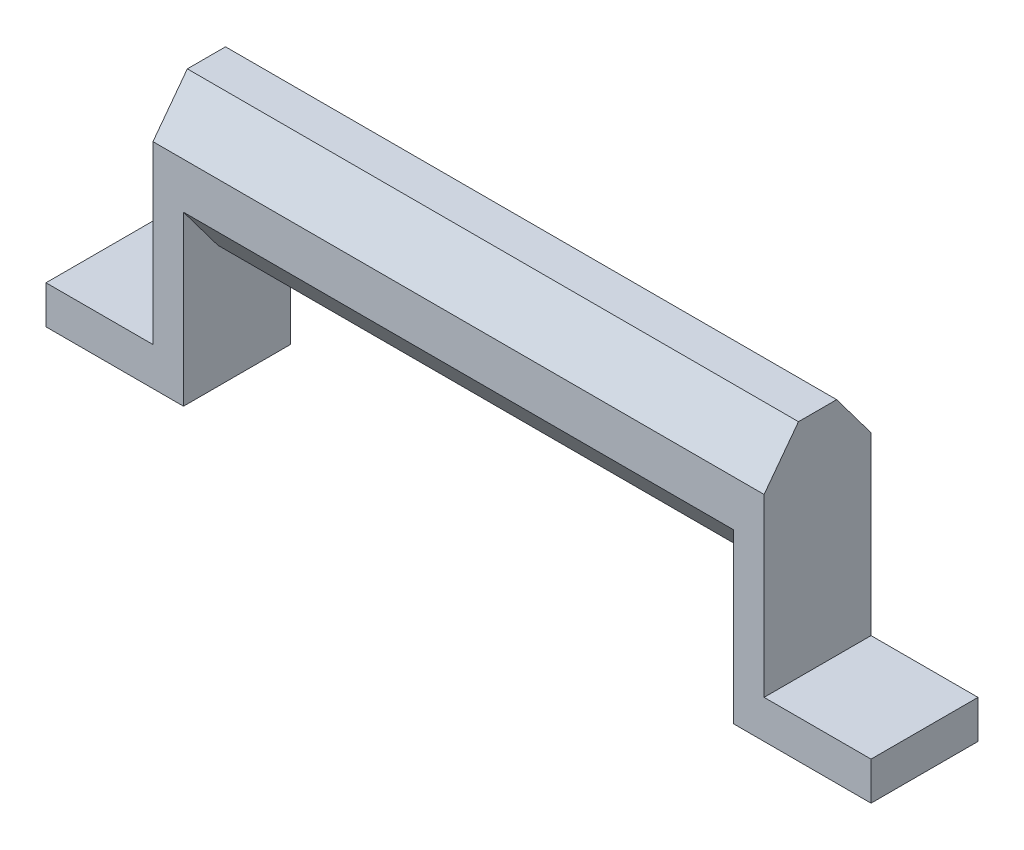
ISO-10303-21;
HEADER;
FILE_DESCRIPTION(('STEP AP214'),'2;1');
FILE_NAME('part.step','',(''),(''),'','','');
FILE_SCHEMA(('AUTOMOTIVE_DESIGN { 1 0 10303 214 1 1 1 1 }'));
ENDSEC;
DATA;
#1=APPLICATION_CONTEXT('core data for automotive mechanical design processes');
#2=APPLICATION_PROTOCOL_DEFINITION('international standard','automotive_design',2000,#1);
#3=PRODUCT_CONTEXT('',#1,'mechanical');
#4=PRODUCT('Part','Part','',(#3));
#5=PRODUCT_RELATED_PRODUCT_CATEGORY('part','',(#4));
#6=PRODUCT_DEFINITION_FORMATION('','',#4);
#7=PRODUCT_DEFINITION_CONTEXT('part definition',#1,'design');
#8=PRODUCT_DEFINITION('design','',#6,#7);
#9=PRODUCT_DEFINITION_SHAPE('','',#8);
#10=(LENGTH_UNIT() NAMED_UNIT(*) SI_UNIT(.MILLI.,.METRE.));
#11=(NAMED_UNIT(*) PLANE_ANGLE_UNIT() SI_UNIT($,.RADIAN.));
#12=(NAMED_UNIT(*) SI_UNIT($,.STERADIAN.) SOLID_ANGLE_UNIT());
#13=UNCERTAINTY_MEASURE_WITH_UNIT(LENGTH_MEASURE(1.E-05),#10,'distance_accuracy_value','');
#14=(GEOMETRIC_REPRESENTATION_CONTEXT(3) GLOBAL_UNCERTAINTY_ASSIGNED_CONTEXT((#13)) GLOBAL_UNIT_ASSIGNED_CONTEXT((#10,
#11,#12)) REPRESENTATION_CONTEXT('',''));
#15=CARTESIAN_POINT('',(0.,0.,0.));
#16=DIRECTION('',(0.,0.,1.));
#17=DIRECTION('',(1.,0.,0.));
#18=AXIS2_PLACEMENT_3D('',#15,#16,#17);
#19=CARTESIAN_POINT('',(0.,0.,0.));
#20=DIRECTION('',(1.,0.,0.));
#21=DIRECTION('',(0.,0.,-1.));
#22=AXIS2_PLACEMENT_3D('',#19,#20,#21);
#23=PLANE('',#22);
#24=DIRECTION('',(0.,0.,-1.));
#25=VECTOR('',#24,1.);
#26=CARTESIAN_POINT('',(0.,-25.4,0.));
#27=LINE('',#26,#25);
#28=CARTESIAN_POINT('',(0.,-25.4,8.89));
#29=VERTEX_POINT('',#28);
#30=CARTESIAN_POINT('',(0.,-25.4,-8.89));
#31=VERTEX_POINT('',#30);
#32=EDGE_CURVE('E61',#29,#31,#27,.T.);
#33=ORIENTED_EDGE('',*,*,#32,.F.);
#34=DIRECTION('',(0.,-1.,0.));
#35=VECTOR('',#34,1.);
#36=CARTESIAN_POINT('',(0.,0.,8.89));
#37=LINE('',#36,#35);
#38=CARTESIAN_POINT('',(0.,3.81,8.89));
#39=VERTEX_POINT('',#38);
#40=EDGE_CURVE('E299',#39,#29,#37,.T.);
#41=ORIENTED_EDGE('',*,*,#40,.F.);
#42=DIRECTION('',(0.,-0.8,0.6));
#43=VECTOR('',#42,1.);
#44=CARTESIAN_POINT('',(0.,5.6388,7.5184));
#45=LINE('',#44,#43);
#46=CARTESIAN_POINT('',(0.,11.43,3.175));
#47=VERTEX_POINT('',#46);
#48=EDGE_CURVE('E315',#47,#39,#45,.T.);
#49=ORIENTED_EDGE('',*,*,#48,.F.);
#50=DIRECTION('',(0.,0.,1.));
#51=VECTOR('',#50,1.);
#52=CARTESIAN_POINT('',(0.,11.43,0.));
#53=LINE('',#52,#51);
#54=CARTESIAN_POINT('',(0.,11.43,-3.175));
#55=VERTEX_POINT('',#54);
#56=EDGE_CURVE('E312',#55,#47,#53,.T.);
#57=ORIENTED_EDGE('',*,*,#56,.F.);
#58=DIRECTION('',(0.,0.8,0.6));
#59=VECTOR('',#58,1.);
#60=CARTESIAN_POINT('',(0.,5.6388,-7.5184));
#61=LINE('',#60,#59);
#62=CARTESIAN_POINT('',(0.,3.81,-8.89));
#63=VERTEX_POINT('',#62);
#64=EDGE_CURVE('E309',#63,#55,#61,.T.);
#65=ORIENTED_EDGE('',*,*,#64,.F.);
#66=DIRECTION('',(0.,-1.,0.));
#67=VECTOR('',#66,1.);
#68=CARTESIAN_POINT('',(0.,0.,-8.89));
#69=LINE('',#68,#67);
#70=EDGE_CURVE('E294',#63,#31,#69,.T.);
#71=ORIENTED_EDGE('',*,*,#70,.T.);
#72=EDGE_LOOP('',(#33,#41,#49,#57,#65,#71));
#73=FACE_BOUND('',#72,.T.);
#74=ADVANCED_FACE('F45',(#73),#23,.F.);
#75=CARTESIAN_POINT('',(5.08,0.,0.));
#76=DIRECTION('',(1.,0.,0.));
#77=DIRECTION('',(0.,0.,-1.));
#78=AXIS2_PLACEMENT_3D('',#75,#76,#77);
#79=PLANE('',#78);
#80=DIRECTION('',(0.,-1.,0.));
#81=VECTOR('',#80,1.);
#82=CARTESIAN_POINT('',(5.08,0.,-8.89));
#83=LINE('',#82,#81);
#84=CARTESIAN_POINT('',(5.08,-3.81,-8.89));
#85=VERTEX_POINT('',#84);
#86=CARTESIAN_POINT('',(5.08,-31.75,-8.89));
#87=VERTEX_POINT('',#86);
#88=EDGE_CURVE('E295',#85,#87,#83,.T.);
#89=ORIENTED_EDGE('',*,*,#88,.F.);
#90=DIRECTION('',(0.,-0.8,0.6));
#91=VECTOR('',#90,1.);
#92=CARTESIAN_POINT('',(5.08,-5.6388,-7.5184));
#93=LINE('',#92,#91);
#94=CARTESIAN_POINT('',(5.08,-11.43,-3.175));
#95=VERTEX_POINT('',#94);
#96=EDGE_CURVE('E287',#85,#95,#93,.T.);
#97=ORIENTED_EDGE('',*,*,#96,.T.);
#98=DIRECTION('',(0.,0.,-1.));
#99=VECTOR('',#98,1.);
#100=CARTESIAN_POINT('',(5.08,-11.43,0.));
#101=LINE('',#100,#99);
#102=CARTESIAN_POINT('',(5.08,-11.43,3.175));
#103=VERTEX_POINT('',#102);
#104=EDGE_CURVE('E291',#103,#95,#101,.T.);
#105=ORIENTED_EDGE('',*,*,#104,.F.);
#106=DIRECTION('',(0.,0.8,0.6));
#107=VECTOR('',#106,1.);
#108=CARTESIAN_POINT('',(5.08,-5.6388,7.5184));
#109=LINE('',#108,#107);
#110=CARTESIAN_POINT('',(5.08,-3.81,8.89));
#111=VERTEX_POINT('',#110);
#112=EDGE_CURVE('E284',#103,#111,#109,.T.);
#113=ORIENTED_EDGE('',*,*,#112,.T.);
#114=DIRECTION('',(0.,-1.,0.));
#115=VECTOR('',#114,1.);
#116=CARTESIAN_POINT('',(5.08,0.,8.89));
#117=LINE('',#116,#115);
#118=CARTESIAN_POINT('',(5.08,-31.75,8.89));
#119=VERTEX_POINT('',#118);
#120=EDGE_CURVE('E298',#111,#119,#117,.T.);
#121=ORIENTED_EDGE('',*,*,#120,.T.);
#122=DIRECTION('',(0.,0.,-1.));
#123=VECTOR('',#122,1.);
#124=CARTESIAN_POINT('',(5.08,-31.75,0.));
#125=LINE('',#124,#123);
#126=EDGE_CURVE('E302',#119,#87,#125,.T.);
#127=ORIENTED_EDGE('',*,*,#126,.T.);
#128=EDGE_LOOP('',(#89,#97,#105,#113,#121,#127));
#129=FACE_BOUND('',#128,.T.);
#130=ADVANCED_FACE('F367',(#129),#79,.T.);
#131=CARTESIAN_POINT('',(5.08,0.,-8.89));
#132=DIRECTION('',(0.,0.,-1.));
#133=DIRECTION('',(0.,1.,0.));
#134=AXIS2_PLACEMENT_3D('',#131,#132,#133);
#135=PLANE('',#134);
#136=DIRECTION('',(-1.,0.,0.));
#137=VECTOR('',#136,1.);
#138=CARTESIAN_POINT('',(50.8,-3.81,-8.89));
#139=LINE('',#138,#137);
#140=CARTESIAN_POINT('',(96.52,-3.81,-8.89));
#141=VERTEX_POINT('',#140);
#142=EDGE_CURVE('E276',#141,#85,#139,.T.);
#143=ORIENTED_EDGE('',*,*,#142,.T.);
#144=ORIENTED_EDGE('',*,*,#88,.T.);
#145=DIRECTION('',(-1.,0.,0.));
#146=VECTOR('',#145,1.);
#147=CARTESIAN_POINT('',(5.08,-31.75,-8.89));
#148=LINE('',#147,#146);
#149=CARTESIAN_POINT('',(-17.78,-31.75,-8.89));
#150=VERTEX_POINT('',#149);
#151=EDGE_CURVE('E306',#87,#150,#148,.T.);
#152=ORIENTED_EDGE('',*,*,#151,.T.);
#153=DIRECTION('',(0.,-1.,0.));
#154=VECTOR('',#153,1.);
#155=CARTESIAN_POINT('',(-17.78,0.,-8.89));
#156=LINE('',#155,#154);
#157=CARTESIAN_POINT('',(-17.78,-25.4,-8.89));
#158=VERTEX_POINT('',#157);
#159=EDGE_CURVE('E256',#158,#150,#156,.T.);
#160=ORIENTED_EDGE('',*,*,#159,.F.);
#161=DIRECTION('',(1.,0.,0.));
#162=VECTOR('',#161,1.);
#163=CARTESIAN_POINT('',(-17.78,-25.4,-8.89));
#164=LINE('',#163,#162);
#165=EDGE_CURVE('E263',#158,#31,#164,.T.);
#166=ORIENTED_EDGE('',*,*,#165,.T.);
#167=ORIENTED_EDGE('',*,*,#70,.F.);
#168=DIRECTION('',(-1.,0.,0.));
#169=VECTOR('',#168,1.);
#170=CARTESIAN_POINT('',(5.08,3.81,-8.89));
#171=LINE('',#170,#169);
#172=CARTESIAN_POINT('',(101.6,3.81,-8.89));
#173=VERTEX_POINT('',#172);
#174=EDGE_CURVE('E11',#173,#63,#171,.T.);
#175=ORIENTED_EDGE('',*,*,#174,.F.);
#176=DIRECTION('',(0.,-1.,0.));
#177=VECTOR('',#176,1.);
#178=CARTESIAN_POINT('',(101.6,0.,-8.89));
#179=LINE('',#178,#177);
#180=CARTESIAN_POINT('',(101.6,-25.4,-8.89));
#181=VERTEX_POINT('',#180);
#182=EDGE_CURVE('E208',#173,#181,#179,.T.);
#183=ORIENTED_EDGE('',*,*,#182,.T.);
#184=DIRECTION('',(-1.,0.,0.));
#185=VECTOR('',#184,1.);
#186=CARTESIAN_POINT('',(119.38,-25.4,-8.89));
#187=LINE('',#186,#185);
#188=CARTESIAN_POINT('',(119.38,-25.4,-8.89));
#189=VERTEX_POINT('',#188);
#190=EDGE_CURVE('E180',#189,#181,#187,.T.);
#191=ORIENTED_EDGE('',*,*,#190,.F.);
#192=DIRECTION('',(0.,-1.,0.));
#193=VECTOR('',#192,1.);
#194=CARTESIAN_POINT('',(119.38,0.,-8.89));
#195=LINE('',#194,#193);
#196=CARTESIAN_POINT('',(119.38,-31.75,-8.89));
#197=VERTEX_POINT('',#196);
#198=EDGE_CURVE('E166',#189,#197,#195,.T.);
#199=ORIENTED_EDGE('',*,*,#198,.T.);
#200=DIRECTION('',(1.,0.,0.));
#201=VECTOR('',#200,1.);
#202=CARTESIAN_POINT('',(96.52,-31.75,-8.89));
#203=LINE('',#202,#201);
#204=CARTESIAN_POINT('',(96.52,-31.75,-8.89));
#205=VERTEX_POINT('',#204);
#206=EDGE_CURVE('E221',#205,#197,#203,.T.);
#207=ORIENTED_EDGE('',*,*,#206,.F.);
#208=DIRECTION('',(0.,-1.,0.));
#209=VECTOR('',#208,1.);
#210=CARTESIAN_POINT('',(96.52,0.,-8.89));
#211=LINE('',#210,#209);
#212=EDGE_CURVE('E209',#141,#205,#211,.T.);
#213=ORIENTED_EDGE('',*,*,#212,.F.);
#214=EDGE_LOOP('',(#143,#144,#152,#160,#166,#167,#175,#183,#191,#199,#207,#213));
#215=FACE_BOUND('',#214,.T.);
#216=ADVANCED_FACE('F47',(#215),#135,.T.);
#217=CARTESIAN_POINT('',(5.08,5.6388,-7.5184));
#218=DIRECTION('',(0.,-0.6,0.8));
#219=DIRECTION('',(0.,-0.8,-0.6));
#220=AXIS2_PLACEMENT_3D('',#217,#218,#219);
#221=PLANE('',#220);
#222=ORIENTED_EDGE('',*,*,#64,.T.);
#223=DIRECTION('',(-1.,0.,0.));
#224=VECTOR('',#223,1.);
#225=CARTESIAN_POINT('',(5.08,11.43,-3.175));
#226=LINE('',#225,#224);
#227=CARTESIAN_POINT('',(101.6,11.43,-3.175));
#228=VERTEX_POINT('',#227);
#229=EDGE_CURVE('E54',#228,#55,#226,.T.);
#230=ORIENTED_EDGE('',*,*,#229,.F.);
#231=DIRECTION('',(0.,0.8,0.6));
#232=VECTOR('',#231,1.);
#233=CARTESIAN_POINT('',(101.6,5.6388,-7.5184));
#234=LINE('',#233,#232);
#235=EDGE_CURVE('E225',#173,#228,#234,.T.);
#236=ORIENTED_EDGE('',*,*,#235,.F.);
#237=ORIENTED_EDGE('',*,*,#174,.T.);
#238=EDGE_LOOP('',(#222,#230,#236,#237));
#239=FACE_BOUND('',#238,.T.);
#240=ADVANCED_FACE('F349',(#239),#221,.F.);
#241=CARTESIAN_POINT('',(5.08,11.43,0.));
#242=DIRECTION('',(0.,-1.,0.));
#243=DIRECTION('',(0.,0.,-1.));
#244=AXIS2_PLACEMENT_3D('',#241,#242,#243);
#245=PLANE('',#244);
#246=ORIENTED_EDGE('',*,*,#56,.T.);
#247=DIRECTION('',(-1.,0.,0.));
#248=VECTOR('',#247,1.);
#249=CARTESIAN_POINT('',(5.08,11.43,3.175));
#250=LINE('',#249,#248);
#251=CARTESIAN_POINT('',(101.6,11.43,3.175));
#252=VERTEX_POINT('',#251);
#253=EDGE_CURVE('E329',#252,#47,#250,.T.);
#254=ORIENTED_EDGE('',*,*,#253,.F.);
#255=DIRECTION('',(0.,0.,1.));
#256=VECTOR('',#255,1.);
#257=CARTESIAN_POINT('',(101.6,11.43,0.));
#258=LINE('',#257,#256);
#259=EDGE_CURVE('E229',#228,#252,#258,.T.);
#260=ORIENTED_EDGE('',*,*,#259,.F.);
#261=ORIENTED_EDGE('',*,*,#229,.T.);
#262=EDGE_LOOP('',(#246,#254,#260,#261));
#263=FACE_BOUND('',#262,.T.);
#264=ADVANCED_FACE('F337',(#263),#245,.F.);
#265=CARTESIAN_POINT('',(5.08,5.6388,7.5184));
#266=DIRECTION('',(0.,-0.6,-0.8));
#267=DIRECTION('',(0.,0.8,-0.6));
#268=AXIS2_PLACEMENT_3D('',#265,#266,#267);
#269=PLANE('',#268);
#270=ORIENTED_EDGE('',*,*,#48,.T.);
#271=DIRECTION('',(-1.,0.,0.));
#272=VECTOR('',#271,1.);
#273=CARTESIAN_POINT('',(5.08,3.81,8.89));
#274=LINE('',#273,#272);
#275=CARTESIAN_POINT('',(101.6,3.81,8.89));
#276=VERTEX_POINT('',#275);
#277=EDGE_CURVE('E325',#276,#39,#274,.T.);
#278=ORIENTED_EDGE('',*,*,#277,.F.);
#279=DIRECTION('',(0.,-0.8,0.6));
#280=VECTOR('',#279,1.);
#281=CARTESIAN_POINT('',(101.6,5.6388,7.5184));
#282=LINE('',#281,#280);
#283=EDGE_CURVE('E233',#252,#276,#282,.T.);
#284=ORIENTED_EDGE('',*,*,#283,.F.);
#285=ORIENTED_EDGE('',*,*,#253,.T.);
#286=EDGE_LOOP('',(#270,#278,#284,#285));
#287=FACE_BOUND('',#286,.T.);
#288=ADVANCED_FACE('F344',(#287),#269,.F.);
#289=CARTESIAN_POINT('',(5.08,0.,8.89));
#290=DIRECTION('',(0.,0.,-1.));
#291=DIRECTION('',(-1.,0.,0.));
#292=AXIS2_PLACEMENT_3D('',#289,#290,#291);
#293=PLANE('',#292);
#294=ORIENTED_EDGE('',*,*,#40,.T.);
#295=DIRECTION('',(1.,0.,0.));
#296=VECTOR('',#295,1.);
#297=CARTESIAN_POINT('',(-17.78,-25.4,8.89));
#298=LINE('',#297,#296);
#299=CARTESIAN_POINT('',(-17.78,-25.4,8.89));
#300=VERTEX_POINT('',#299);
#301=EDGE_CURVE('E260',#300,#29,#298,.T.);
#302=ORIENTED_EDGE('',*,*,#301,.F.);
#303=DIRECTION('',(0.,-1.,0.));
#304=VECTOR('',#303,1.);
#305=CARTESIAN_POINT('',(-17.78,0.,8.89));
#306=LINE('',#305,#304);
#307=CARTESIAN_POINT('',(-17.78,-31.75,8.89));
#308=VERTEX_POINT('',#307);
#309=EDGE_CURVE('E248',#300,#308,#306,.T.);
#310=ORIENTED_EDGE('',*,*,#309,.T.);
#311=DIRECTION('',(-1.,0.,0.));
#312=VECTOR('',#311,1.);
#313=CARTESIAN_POINT('',(5.08,-31.75,8.89));
#314=LINE('',#313,#312);
#315=EDGE_CURVE('E322',#119,#308,#314,.T.);
#316=ORIENTED_EDGE('',*,*,#315,.F.);
#317=ORIENTED_EDGE('',*,*,#120,.F.);
#318=DIRECTION('',(-1.,0.,0.));
#319=VECTOR('',#318,1.);
#320=CARTESIAN_POINT('',(50.8,-3.81,8.88999999999999));
#321=LINE('',#320,#319);
#322=CARTESIAN_POINT('',(96.52,-3.81,8.89));
#323=VERTEX_POINT('',#322);
#324=EDGE_CURVE('E69',#323,#111,#321,.T.);
#325=ORIENTED_EDGE('',*,*,#324,.F.);
#326=DIRECTION('',(0.,-1.,0.));
#327=VECTOR('',#326,1.);
#328=CARTESIAN_POINT('',(96.52,0.,8.89));
#329=LINE('',#328,#327);
#330=CARTESIAN_POINT('',(96.52,-31.75,8.89));
#331=VERTEX_POINT('',#330);
#332=EDGE_CURVE('E213',#323,#331,#329,.T.);
#333=ORIENTED_EDGE('',*,*,#332,.T.);
#334=DIRECTION('',(1.,0.,0.));
#335=VECTOR('',#334,1.);
#336=CARTESIAN_POINT('',(96.52,-31.75,8.89));
#337=LINE('',#336,#335);
#338=CARTESIAN_POINT('',(119.38,-31.75,8.89));
#339=VERTEX_POINT('',#338);
#340=EDGE_CURVE('E184',#331,#339,#337,.T.);
#341=ORIENTED_EDGE('',*,*,#340,.T.);
#342=DIRECTION('',(0.,-1.,0.));
#343=VECTOR('',#342,1.);
#344=CARTESIAN_POINT('',(119.38,0.,8.89));
#345=LINE('',#344,#343);
#346=CARTESIAN_POINT('',(119.38,-25.4,8.89));
#347=VERTEX_POINT('',#346);
#348=EDGE_CURVE('E163',#347,#339,#345,.T.);
#349=ORIENTED_EDGE('',*,*,#348,.F.);
#350=DIRECTION('',(-1.,0.,0.));
#351=VECTOR('',#350,1.);
#352=CARTESIAN_POINT('',(119.38,-25.4,8.89));
#353=LINE('',#352,#351);
#354=CARTESIAN_POINT('',(101.6,-25.4,8.89));
#355=VERTEX_POINT('',#354);
#356=EDGE_CURVE('E173',#347,#355,#353,.T.);
#357=ORIENTED_EDGE('',*,*,#356,.T.);
#358=DIRECTION('',(0.,-1.,0.));
#359=VECTOR('',#358,1.);
#360=CARTESIAN_POINT('',(101.6,0.,8.89));
#361=LINE('',#360,#359);
#362=EDGE_CURVE('E214',#276,#355,#361,.T.);
#363=ORIENTED_EDGE('',*,*,#362,.F.);
#364=ORIENTED_EDGE('',*,*,#277,.T.);
#365=EDGE_LOOP('',(#294,#302,#310,#316,#317,#325,#333,#341,#349,#357,#363,#364));
#366=FACE_BOUND('',#365,.T.);
#367=ADVANCED_FACE('F182',(#366),#293,.F.);
#368=CARTESIAN_POINT('',(5.08,-31.75,0.));
#369=DIRECTION('',(0.,1.,0.));
#370=DIRECTION('',(0.,0.,1.));
#371=AXIS2_PLACEMENT_3D('',#368,#369,#370);
#372=PLANE('',#371);
#373=ORIENTED_EDGE('',*,*,#315,.T.);
#374=DIRECTION('',(0.,0.,-1.));
#375=VECTOR('',#374,1.);
#376=CARTESIAN_POINT('',(-17.78,-31.75,0.));
#377=LINE('',#376,#375);
#378=EDGE_CURVE('E252',#308,#150,#377,.T.);
#379=ORIENTED_EDGE('',*,*,#378,.T.);
#380=ORIENTED_EDGE('',*,*,#151,.F.);
#381=ORIENTED_EDGE('',*,*,#126,.F.);
#382=EDGE_LOOP('',(#373,#379,#380,#381));
#383=FACE_BOUND('',#382,.T.);
#384=ADVANCED_FACE('F364',(#383),#372,.F.);
#385=CARTESIAN_POINT('',(50.8,-11.43,0.));
#386=DIRECTION('',(0.,-1.,0.));
#387=DIRECTION('',(0.,0.,-1.));
#388=AXIS2_PLACEMENT_3D('',#385,#386,#387);
#389=PLANE('',#388);
#390=DIRECTION('',(-1.,0.,0.));
#391=VECTOR('',#390,1.);
#392=CARTESIAN_POINT('',(50.8,-11.43,3.175));
#393=LINE('',#392,#391);
#394=CARTESIAN_POINT('',(96.52,-11.43,3.175));
#395=VERTEX_POINT('',#394);
#396=EDGE_CURVE('E267',#395,#103,#393,.T.);
#397=ORIENTED_EDGE('',*,*,#396,.T.);
#398=ORIENTED_EDGE('',*,*,#104,.T.);
#399=DIRECTION('',(-1.,0.,0.));
#400=VECTOR('',#399,1.);
#401=CARTESIAN_POINT('',(50.8,-11.43,-3.175));
#402=LINE('',#401,#400);
#403=CARTESIAN_POINT('',(96.52,-11.43,-3.175));
#404=VERTEX_POINT('',#403);
#405=EDGE_CURVE('E280',#404,#95,#402,.T.);
#406=ORIENTED_EDGE('',*,*,#405,.F.);
#407=DIRECTION('',(0.,0.,-1.));
#408=VECTOR('',#407,1.);
#409=CARTESIAN_POINT('',(96.52,-11.43,0.));
#410=LINE('',#409,#408);
#411=EDGE_CURVE('E204',#395,#404,#410,.T.);
#412=ORIENTED_EDGE('',*,*,#411,.F.);
#413=EDGE_LOOP('',(#397,#398,#406,#412));
#414=FACE_BOUND('',#413,.T.);
#415=ADVANCED_FACE('F383',(#414),#389,.T.);
#416=CARTESIAN_POINT('',(50.8,-5.6388,-7.5184));
#417=DIRECTION('',(0.,0.6,0.8));
#418=DIRECTION('',(0.,-0.8,0.6));
#419=AXIS2_PLACEMENT_3D('',#416,#417,#418);
#420=PLANE('',#419);
#421=ORIENTED_EDGE('',*,*,#96,.F.);
#422=ORIENTED_EDGE('',*,*,#142,.F.);
#423=DIRECTION('',(0.,-0.8,0.6));
#424=VECTOR('',#423,1.);
#425=CARTESIAN_POINT('',(96.52,-5.6388,-7.5184));
#426=LINE('',#425,#424);
#427=EDGE_CURVE('E200',#141,#404,#426,.T.);
#428=ORIENTED_EDGE('',*,*,#427,.T.);
#429=ORIENTED_EDGE('',*,*,#405,.T.);
#430=EDGE_LOOP('',(#421,#422,#428,#429));
#431=FACE_BOUND('',#430,.T.);
#432=ADVANCED_FACE('F381',(#431),#420,.F.);
#433=CARTESIAN_POINT('',(50.8,-5.6388,7.5184));
#434=DIRECTION('',(0.,0.6,-0.8));
#435=DIRECTION('',(0.,0.8,0.6));
#436=AXIS2_PLACEMENT_3D('',#433,#434,#435);
#437=PLANE('',#436);
#438=ORIENTED_EDGE('',*,*,#112,.F.);
#439=ORIENTED_EDGE('',*,*,#396,.F.);
#440=DIRECTION('',(0.,0.8,0.6));
#441=VECTOR('',#440,1.);
#442=CARTESIAN_POINT('',(96.52,-5.6388,7.5184));
#443=LINE('',#442,#441);
#444=EDGE_CURVE('E196',#395,#323,#443,.T.);
#445=ORIENTED_EDGE('',*,*,#444,.T.);
#446=ORIENTED_EDGE('',*,*,#324,.T.);
#447=EDGE_LOOP('',(#438,#439,#445,#446));
#448=FACE_BOUND('',#447,.T.);
#449=ADVANCED_FACE('F372',(#448),#437,.F.);
#450=CARTESIAN_POINT('',(-17.78,-25.4,0.));
#451=DIRECTION('',(0.,-1.,0.));
#452=DIRECTION('',(0.,0.,-1.));
#453=AXIS2_PLACEMENT_3D('',#450,#451,#452);
#454=PLANE('',#453);
#455=ORIENTED_EDGE('',*,*,#32,.T.);
#456=ORIENTED_EDGE('',*,*,#165,.F.);
#457=DIRECTION('',(0.,0.,-1.));
#458=VECTOR('',#457,1.);
#459=CARTESIAN_POINT('',(-17.78,-25.4,0.));
#460=LINE('',#459,#458);
#461=EDGE_CURVE('E244',#300,#158,#460,.T.);
#462=ORIENTED_EDGE('',*,*,#461,.F.);
#463=ORIENTED_EDGE('',*,*,#301,.T.);
#464=EDGE_LOOP('',(#455,#456,#462,#463));
#465=FACE_BOUND('',#464,.T.);
#466=ADVANCED_FACE('F354',(#465),#454,.F.);
#467=CARTESIAN_POINT('',(-17.78,0.,0.));
#468=DIRECTION('',(1.,0.,0.));
#469=DIRECTION('',(0.,0.,-1.));
#470=AXIS2_PLACEMENT_3D('',#467,#468,#469);
#471=PLANE('',#470);
#472=ORIENTED_EDGE('',*,*,#461,.T.);
#473=ORIENTED_EDGE('',*,*,#159,.T.);
#474=ORIENTED_EDGE('',*,*,#378,.F.);
#475=ORIENTED_EDGE('',*,*,#309,.F.);
#476=EDGE_LOOP('',(#472,#473,#474,#475));
#477=FACE_BOUND('',#476,.T.);
#478=ADVANCED_FACE('F361',(#477),#471,.F.);
#479=CARTESIAN_POINT('',(101.6,0.,0.));
#480=DIRECTION('',(-1.,0.,0.));
#481=DIRECTION('',(0.,0.,-1.));
#482=AXIS2_PLACEMENT_3D('',#479,#480,#481);
#483=PLANE('',#482);
#484=DIRECTION('',(0.,0.,-1.));
#485=VECTOR('',#484,1.);
#486=CARTESIAN_POINT('',(101.6,-25.4,0.));
#487=LINE('',#486,#485);
#488=EDGE_CURVE('E170',#355,#181,#487,.T.);
#489=ORIENTED_EDGE('',*,*,#488,.T.);
#490=ORIENTED_EDGE('',*,*,#182,.F.);
#491=ORIENTED_EDGE('',*,*,#235,.T.);
#492=ORIENTED_EDGE('',*,*,#259,.T.);
#493=ORIENTED_EDGE('',*,*,#283,.T.);
#494=ORIENTED_EDGE('',*,*,#362,.T.);
#495=EDGE_LOOP('',(#489,#490,#491,#492,#493,#494));
#496=FACE_BOUND('',#495,.T.);
#497=ADVANCED_FACE('F347',(#496),#483,.F.);
#498=CARTESIAN_POINT('',(96.52,0.,0.));
#499=DIRECTION('',(-1.,0.,0.));
#500=DIRECTION('',(0.,0.,-1.));
#501=AXIS2_PLACEMENT_3D('',#498,#499,#500);
#502=PLANE('',#501);
#503=ORIENTED_EDGE('',*,*,#212,.T.);
#504=DIRECTION('',(0.,0.,-1.));
#505=VECTOR('',#504,1.);
#506=CARTESIAN_POINT('',(96.52,-31.75,0.));
#507=LINE('',#506,#505);
#508=EDGE_CURVE('E217',#331,#205,#507,.T.);
#509=ORIENTED_EDGE('',*,*,#508,.F.);
#510=ORIENTED_EDGE('',*,*,#332,.F.);
#511=ORIENTED_EDGE('',*,*,#444,.F.);
#512=ORIENTED_EDGE('',*,*,#411,.T.);
#513=ORIENTED_EDGE('',*,*,#427,.F.);
#514=EDGE_LOOP('',(#503,#509,#510,#511,#512,#513));
#515=FACE_BOUND('',#514,.T.);
#516=ADVANCED_FACE('F375',(#515),#502,.T.);
#517=CARTESIAN_POINT('',(96.52,-31.75,0.));
#518=DIRECTION('',(0.,1.,0.));
#519=DIRECTION('',(0.,0.,1.));
#520=AXIS2_PLACEMENT_3D('',#517,#518,#519);
#521=PLANE('',#520);
#522=ORIENTED_EDGE('',*,*,#340,.F.);
#523=ORIENTED_EDGE('',*,*,#508,.T.);
#524=ORIENTED_EDGE('',*,*,#206,.T.);
#525=DIRECTION('',(0.,0.,-1.));
#526=VECTOR('',#525,1.);
#527=CARTESIAN_POINT('',(119.38,-31.75,0.));
#528=LINE('',#527,#526);
#529=EDGE_CURVE('E186',#339,#197,#528,.T.);
#530=ORIENTED_EDGE('',*,*,#529,.F.);
#531=EDGE_LOOP('',(#522,#523,#524,#530));
#532=FACE_BOUND('',#531,.T.);
#533=ADVANCED_FACE('F379',(#532),#521,.F.);
#534=CARTESIAN_POINT('',(119.38,-25.4,0.));
#535=DIRECTION('',(0.,-1.,0.));
#536=DIRECTION('',(0.,0.,-1.));
#537=AXIS2_PLACEMENT_3D('',#534,#535,#536);
#538=PLANE('',#537);
#539=ORIENTED_EDGE('',*,*,#488,.F.);
#540=ORIENTED_EDGE('',*,*,#356,.F.);
#541=DIRECTION('',(0.,0.,-1.));
#542=VECTOR('',#541,1.);
#543=CARTESIAN_POINT('',(119.38,-25.4,0.));
#544=LINE('',#543,#542);
#545=EDGE_CURVE('E159',#347,#189,#544,.T.);
#546=ORIENTED_EDGE('',*,*,#545,.T.);
#547=ORIENTED_EDGE('',*,*,#190,.T.);
#548=EDGE_LOOP('',(#539,#540,#546,#547));
#549=FACE_BOUND('',#548,.T.);
#550=ADVANCED_FACE('F174',(#549),#538,.F.);
#551=CARTESIAN_POINT('',(119.38,0.,0.));
#552=DIRECTION('',(-1.,0.,0.));
#553=DIRECTION('',(0.,0.,-1.));
#554=AXIS2_PLACEMENT_3D('',#551,#552,#553);
#555=PLANE('',#554);
#556=ORIENTED_EDGE('',*,*,#545,.F.);
#557=ORIENTED_EDGE('',*,*,#348,.T.);
#558=ORIENTED_EDGE('',*,*,#529,.T.);
#559=ORIENTED_EDGE('',*,*,#198,.F.);
#560=EDGE_LOOP('',(#556,#557,#558,#559));
#561=FACE_BOUND('',#560,.T.);
#562=ADVANCED_FACE('F161',(#561),#555,.F.);
#563=CLOSED_SHELL('',(#74,#130,#216,#240,#264,#288,#367,#384,#415,#432,#449,#466,#478,#497,#516,
#533,#550,#562));
#564=MANIFOLD_SOLID_BREP('B2',#563);
#565=ADVANCED_BREP_SHAPE_REPRESENTATION('',(#18,#564),#14);
#566=SHAPE_DEFINITION_REPRESENTATION(#9,#565);
ENDSEC;
END-ISO-10303-21;
